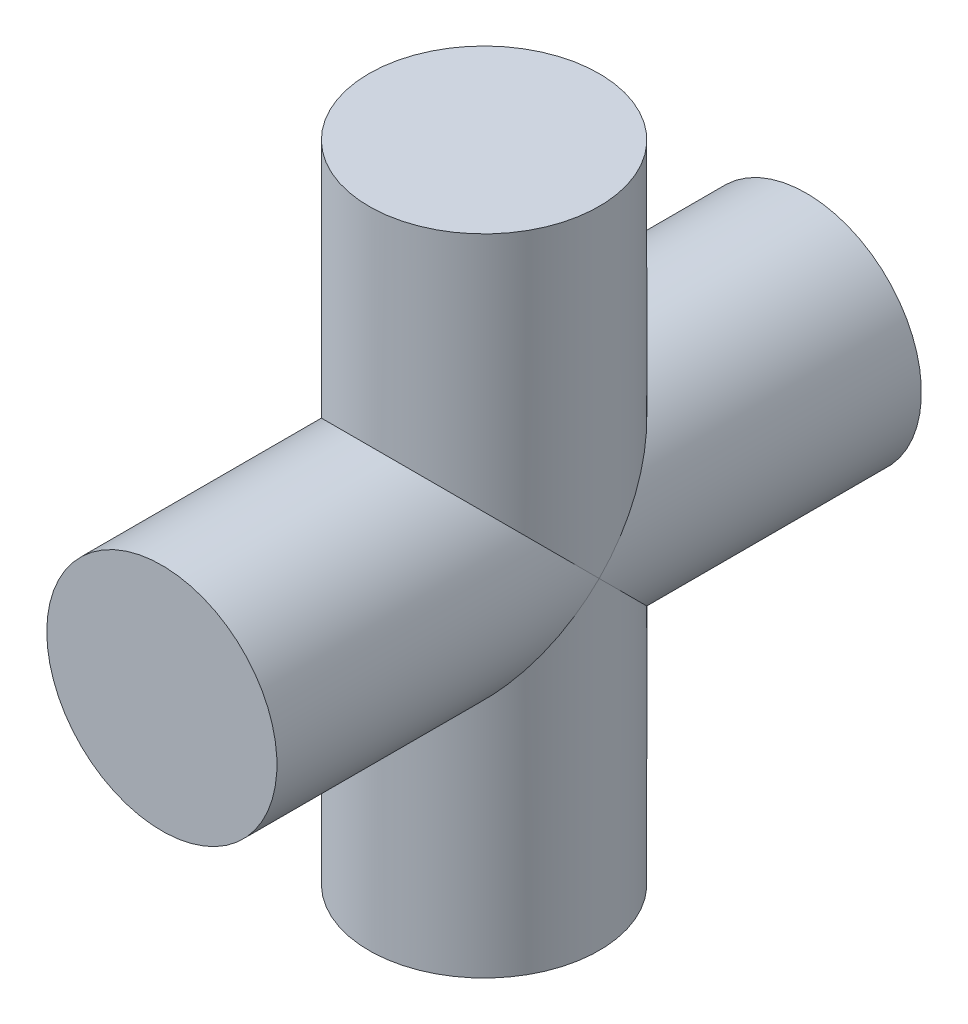
ISO-10303-21;
HEADER;
FILE_DESCRIPTION(('STEP AP214'),'2;1');
FILE_NAME('part.step','',(''),(''),'','','');
FILE_SCHEMA(('AUTOMOTIVE_DESIGN { 1 0 10303 214 1 1 1 1 }'));
ENDSEC;
DATA;
#1=APPLICATION_CONTEXT('core data for automotive mechanical design processes');
#2=APPLICATION_PROTOCOL_DEFINITION('international standard','automotive_design',2000,#1);
#3=PRODUCT_CONTEXT('',#1,'mechanical');
#4=PRODUCT('Part','Part','',(#3));
#5=PRODUCT_RELATED_PRODUCT_CATEGORY('part','',(#4));
#6=PRODUCT_DEFINITION_FORMATION('','',#4);
#7=PRODUCT_DEFINITION_CONTEXT('part definition',#1,'design');
#8=PRODUCT_DEFINITION('design','',#6,#7);
#9=PRODUCT_DEFINITION_SHAPE('','',#8);
#10=(LENGTH_UNIT() NAMED_UNIT(*) SI_UNIT(.MILLI.,.METRE.));
#11=(NAMED_UNIT(*) PLANE_ANGLE_UNIT() SI_UNIT($,.RADIAN.));
#12=(NAMED_UNIT(*) SI_UNIT($,.STERADIAN.) SOLID_ANGLE_UNIT());
#13=UNCERTAINTY_MEASURE_WITH_UNIT(LENGTH_MEASURE(1.E-05),#10,'distance_accuracy_value','');
#14=(GEOMETRIC_REPRESENTATION_CONTEXT(3) GLOBAL_UNCERTAINTY_ASSIGNED_CONTEXT((#13)) GLOBAL_UNIT_ASSIGNED_CONTEXT((#10,
#11,#12)) REPRESENTATION_CONTEXT('',''));
#15=CARTESIAN_POINT('',(0.,0.,0.));
#16=DIRECTION('',(0.,0.,1.));
#17=DIRECTION('',(1.,0.,0.));
#18=AXIS2_PLACEMENT_3D('',#15,#16,#17);
#19=CARTESIAN_POINT('',(0.,21.,0.));
#20=DIRECTION('',(0.,1.,0.));
#21=DIRECTION('',(-1.,0.,0.));
#22=AXIS2_PLACEMENT_3D('',#19,#20,#21);
#23=CYLINDRICAL_SURFACE('',#22,7.5);
#24=CARTESIAN_POINT('',(0.,0.,0.));
#25=DIRECTION('',(0.,0.707106781186547,-0.707106781186547));
#26=DIRECTION('',(0.,0.707106781186547,0.707106781186547));
#27=AXIS2_PLACEMENT_3D('',#24,#25,#26);
#28=ELLIPSE('',#27,10.6066017177982,7.5);
#29=CARTESIAN_POINT('',(7.5,0.,0.));
#30=VERTEX_POINT('',#29);
#31=CARTESIAN_POINT('',(-7.5,0.,0.));
#32=VERTEX_POINT('',#31);
#33=EDGE_CURVE('E38',#30,#32,#28,.T.);
#34=ORIENTED_EDGE('',*,*,#33,.F.);
#35=CARTESIAN_POINT('',(0.,0.,0.));
#36=DIRECTION('',(0.,0.707106781186547,0.707106781186547));
#37=DIRECTION('',(0.,0.707106781186547,-0.707106781186547));
#38=AXIS2_PLACEMENT_3D('',#35,#36,#37);
#39=ELLIPSE('',#38,10.6066017177982,7.5);
#40=EDGE_CURVE('E50',#32,#30,#39,.T.);
#41=ORIENTED_EDGE('',*,*,#40,.F.);
#42=EDGE_LOOP('',(#34,#41));
#43=FACE_BOUND('',#42,.T.);
#44=CARTESIAN_POINT('',(0.,-21.,0.));
#45=DIRECTION('',(0.,1.,0.));
#46=DIRECTION('',(-1.,0.,0.));
#47=AXIS2_PLACEMENT_3D('',#44,#45,#46);
#48=CIRCLE('',#47,7.5);
#49=CARTESIAN_POINT('',(-7.49999999999999,-21.,0.));
#50=VERTEX_POINT('',#49);
#51=EDGE_CURVE('E57',#50,#50,#48,.T.);
#52=ORIENTED_EDGE('',*,*,#51,.T.);
#53=EDGE_LOOP('',(#52));
#54=FACE_BOUND('',#53,.T.);
#55=ADVANCED_FACE('F31',(#43,#54),#23,.T.);
#56=CARTESIAN_POINT('',(-7.49999999999999,-21.,0.));
#57=DIRECTION('',(0.,-1.,0.));
#58=DIRECTION('',(1.,0.,0.));
#59=AXIS2_PLACEMENT_3D('',#56,#57,#58);
#60=PLANE('',#59);
#61=ORIENTED_EDGE('',*,*,#51,.F.);
#62=EDGE_LOOP('',(#61));
#63=FACE_BOUND('',#62,.T.);
#64=ADVANCED_FACE('F80',(#63),#60,.T.);
#65=CARTESIAN_POINT('',(-7.5,0.,-21.));
#66=DIRECTION('',(0.,0.,-1.));
#67=DIRECTION('',(-1.,0.,0.));
#68=AXIS2_PLACEMENT_3D('',#65,#66,#67);
#69=PLANE('',#68);
#70=CARTESIAN_POINT('',(0.,0.,-21.));
#71=DIRECTION('',(0.,0.,-1.));
#72=DIRECTION('',(-1.,0.,0.));
#73=AXIS2_PLACEMENT_3D('',#70,#71,#72);
#74=CIRCLE('',#73,7.5);
#75=CARTESIAN_POINT('',(-7.5,0.,-21.));
#76=VERTEX_POINT('',#75);
#77=EDGE_CURVE('E70',#76,#76,#74,.T.);
#78=ORIENTED_EDGE('',*,*,#77,.T.);
#79=EDGE_LOOP('',(#78));
#80=FACE_BOUND('',#79,.T.);
#81=ADVANCED_FACE('F82',(#80),#69,.T.);
#82=CARTESIAN_POINT('',(0.,0.,-21.));
#83=DIRECTION('',(0.,0.,-1.));
#84=DIRECTION('',(-1.,0.,0.));
#85=AXIS2_PLACEMENT_3D('',#82,#83,#84);
#86=CYLINDRICAL_SURFACE('',#85,7.5);
#87=ORIENTED_EDGE('',*,*,#77,.F.);
#88=EDGE_LOOP('',(#87));
#89=FACE_BOUND('',#88,.T.);
#90=CARTESIAN_POINT('',(0.,0.,0.));
#91=DIRECTION('',(0.,0.707106781186547,0.707106781186547));
#92=DIRECTION('',(0.,0.707106781186547,-0.707106781186547));
#93=AXIS2_PLACEMENT_3D('',#90,#91,#92);
#94=ELLIPSE('',#93,10.6066017177982,7.5);
#95=EDGE_CURVE('E44',#32,#30,#94,.F.);
#96=ORIENTED_EDGE('',*,*,#95,.T.);
#97=ORIENTED_EDGE('',*,*,#33,.T.);
#98=EDGE_LOOP('',(#96,#97));
#99=FACE_BOUND('',#98,.T.);
#100=ADVANCED_FACE('F59',(#89,#99),#86,.T.);
#101=CARTESIAN_POINT('',(-7.5,21.,0.));
#102=DIRECTION('',(0.,1.,0.));
#103=DIRECTION('',(-1.,0.,0.));
#104=AXIS2_PLACEMENT_3D('',#101,#102,#103);
#105=PLANE('',#104);
#106=CARTESIAN_POINT('',(0.,21.,0.));
#107=DIRECTION('',(0.,1.,0.));
#108=DIRECTION('',(-1.,0.,0.));
#109=AXIS2_PLACEMENT_3D('',#106,#107,#108);
#110=CIRCLE('',#109,7.5);
#111=CARTESIAN_POINT('',(-7.5,21.,0.));
#112=VERTEX_POINT('',#111);
#113=EDGE_CURVE('E69',#112,#112,#110,.T.);
#114=ORIENTED_EDGE('',*,*,#113,.T.);
#115=EDGE_LOOP('',(#114));
#116=FACE_BOUND('',#115,.T.);
#117=ADVANCED_FACE('F90',(#116),#105,.T.);
#118=CARTESIAN_POINT('',(0.,0.,0.));
#119=DIRECTION('',(0.,0.707106781186547,-0.707106781186547));
#120=DIRECTION('',(0.,0.707106781186547,0.707106781186547));
#121=AXIS2_PLACEMENT_3D('',#118,#119,#120);
#122=ELLIPSE('',#121,10.6066017177982,7.5);
#123=EDGE_CURVE('E11',#30,#32,#122,.F.);
#124=ORIENTED_EDGE('',*,*,#123,.F.);
#125=ORIENTED_EDGE('',*,*,#95,.F.);
#126=EDGE_LOOP('',(#124,#125));
#127=FACE_BOUND('',#126,.T.);
#128=ORIENTED_EDGE('',*,*,#113,.F.);
#129=EDGE_LOOP('',(#128));
#130=FACE_BOUND('',#129,.T.);
#131=ADVANCED_FACE('F55',(#127,#130),#23,.T.);
#132=ORIENTED_EDGE('',*,*,#40,.T.);
#133=ORIENTED_EDGE('',*,*,#123,.T.);
#134=EDGE_LOOP('',(#132,#133));
#135=FACE_BOUND('',#134,.T.);
#136=CARTESIAN_POINT('',(0.,0.,21.));
#137=DIRECTION('',(0.,0.,-1.));
#138=DIRECTION('',(-1.,0.,0.));
#139=AXIS2_PLACEMENT_3D('',#136,#137,#138);
#140=CIRCLE('',#139,7.5);
#141=CARTESIAN_POINT('',(-7.49999999999999,0.,21.));
#142=VERTEX_POINT('',#141);
#143=EDGE_CURVE('E67',#142,#142,#140,.T.);
#144=ORIENTED_EDGE('',*,*,#143,.T.);
#145=EDGE_LOOP('',(#144));
#146=FACE_BOUND('',#145,.T.);
#147=ADVANCED_FACE('F60',(#135,#146),#86,.T.);
#148=CARTESIAN_POINT('',(-7.49999999999999,0.,21.));
#149=DIRECTION('',(0.,0.,1.));
#150=DIRECTION('',(1.,0.,0.));
#151=AXIS2_PLACEMENT_3D('',#148,#149,#150);
#152=PLANE('',#151);
#153=ORIENTED_EDGE('',*,*,#143,.F.);
#154=EDGE_LOOP('',(#153));
#155=FACE_BOUND('',#154,.T.);
#156=ADVANCED_FACE('F63',(#155),#152,.T.);
#157=CLOSED_SHELL('',(#55,#64,#81,#100,#117,#131,#147,#156));
#158=MANIFOLD_SOLID_BREP('B2',#157);
#159=ADVANCED_BREP_SHAPE_REPRESENTATION('',(#18,#158),#14);
#160=SHAPE_DEFINITION_REPRESENTATION(#9,#159);
ENDSEC;
END-ISO-10303-21;
